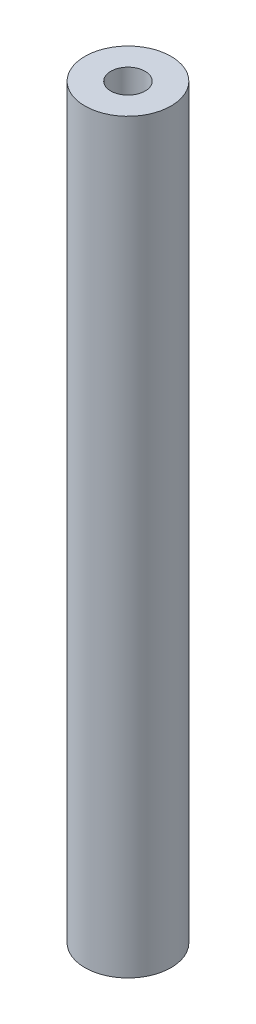
ISO-10303-21;
HEADER;
FILE_DESCRIPTION(('STEP AP214'),'2;1');
FILE_NAME('part.step','',(''),(''),'','','');
FILE_SCHEMA(('AUTOMOTIVE_DESIGN { 1 0 10303 214 1 1 1 1 }'));
ENDSEC;
DATA;
#1=APPLICATION_CONTEXT('core data for automotive mechanical design processes');
#2=APPLICATION_PROTOCOL_DEFINITION('international standard','automotive_design',2000,#1);
#3=PRODUCT_CONTEXT('',#1,'mechanical');
#4=PRODUCT('Part','Part','',(#3));
#5=PRODUCT_RELATED_PRODUCT_CATEGORY('part','',(#4));
#6=PRODUCT_DEFINITION_FORMATION('','',#4);
#7=PRODUCT_DEFINITION_CONTEXT('part definition',#1,'design');
#8=PRODUCT_DEFINITION('design','',#6,#7);
#9=PRODUCT_DEFINITION_SHAPE('','',#8);
#10=(LENGTH_UNIT() NAMED_UNIT(*) SI_UNIT(.MILLI.,.METRE.));
#11=(NAMED_UNIT(*) PLANE_ANGLE_UNIT() SI_UNIT($,.RADIAN.));
#12=(NAMED_UNIT(*) SI_UNIT($,.STERADIAN.) SOLID_ANGLE_UNIT());
#13=UNCERTAINTY_MEASURE_WITH_UNIT(LENGTH_MEASURE(1.E-05),#10,'distance_accuracy_value','');
#14=(GEOMETRIC_REPRESENTATION_CONTEXT(3) GLOBAL_UNCERTAINTY_ASSIGNED_CONTEXT((#13)) GLOBAL_UNIT_ASSIGNED_CONTEXT((#10,
#11,#12)) REPRESENTATION_CONTEXT('',''));
#15=CARTESIAN_POINT('',(0.,0.,0.));
#16=DIRECTION('',(0.,0.,1.));
#17=DIRECTION('',(1.,0.,0.));
#18=AXIS2_PLACEMENT_3D('',#15,#16,#17);
#19=CARTESIAN_POINT('',(-31.6080778217774,-139.528044181604,60.718552563549));
#20=DIRECTION('',(0.,1.,0.));
#21=DIRECTION('',(0.,0.,1.));
#22=AXIS2_PLACEMENT_3D('',#19,#20,#21);
#23=CYLINDRICAL_SURFACE('',#22,4.7625);
#24=CARTESIAN_POINT('',(-31.6080778217774,-126.05766,60.718552563549));
#25=DIRECTION('',(0.,1.,0.));
#26=DIRECTION('',(0.,0.,1.));
#27=AXIS2_PLACEMENT_3D('',#24,#25,#26);
#28=CIRCLE('',#27,4.7625);
#29=CARTESIAN_POINT('',(-31.6080778217774,-126.05766,65.481052563549));
#30=VERTEX_POINT('',#29);
#31=EDGE_CURVE('E11',#30,#30,#28,.F.);
#32=ORIENTED_EDGE('',*,*,#31,.F.);
#33=EDGE_LOOP('',(#32));
#34=FACE_BOUND('',#33,.T.);
#35=CARTESIAN_POINT('',(-31.6080778217774,-43.50766,60.718552563549));
#36=DIRECTION('',(0.,1.,0.));
#37=DIRECTION('',(0.,0.,1.));
#38=AXIS2_PLACEMENT_3D('',#35,#36,#37);
#39=CIRCLE('',#38,4.7625);
#40=CARTESIAN_POINT('',(-31.6080778217774,-43.50766,65.481052563549));
#41=VERTEX_POINT('',#40);
#42=EDGE_CURVE('E52',#41,#41,#39,.T.);
#43=ORIENTED_EDGE('',*,*,#42,.F.);
#44=EDGE_LOOP('',(#43));
#45=FACE_BOUND('',#44,.T.);
#46=ADVANCED_FACE('F45',(#34,#45),#23,.T.);
#47=CARTESIAN_POINT('',(-31.6080778217774,-43.50766,60.718552563549));
#48=DIRECTION('',(0.,1.,0.));
#49=DIRECTION('',(0.,0.,1.));
#50=AXIS2_PLACEMENT_3D('',#47,#48,#49);
#51=PLANE('',#50);
#52=CARTESIAN_POINT('',(-31.6080778217774,-43.50766,60.718552563549));
#53=DIRECTION('',(0.,1.,0.));
#54=DIRECTION('',(0.,0.,1.));
#55=AXIS2_PLACEMENT_3D('',#52,#53,#54);
#56=CIRCLE('',#55,1.89864999999999);
#57=CARTESIAN_POINT('',(-31.6080778217774,-43.50766,62.617202563549));
#58=VERTEX_POINT('',#57);
#59=EDGE_CURVE('E66',#58,#58,#56,.T.);
#60=ORIENTED_EDGE('',*,*,#59,.F.);
#61=EDGE_LOOP('',(#60));
#62=FACE_BOUND('',#61,.T.);
#63=ORIENTED_EDGE('',*,*,#42,.T.);
#64=EDGE_LOOP('',(#63));
#65=FACE_BOUND('',#64,.T.);
#66=ADVANCED_FACE('F76',(#62,#65),#51,.T.);
#67=CARTESIAN_POINT('',(0.,-126.05766,0.));
#68=DIRECTION('',(0.,1.,0.));
#69=DIRECTION('',(0.,0.,1.));
#70=AXIS2_PLACEMENT_3D('',#67,#68,#69);
#71=PLANE('',#70);
#72=ORIENTED_EDGE('',*,*,#31,.T.);
#73=EDGE_LOOP('',(#72));
#74=FACE_BOUND('',#73,.T.);
#75=ADVANCED_FACE('F59',(#74),#71,.F.);
#76=CARTESIAN_POINT('',(-31.6080778217774,-49.85766,60.718552563549));
#77=DIRECTION('',(0.,1.,0.));
#78=DIRECTION('',(0.,0.,1.));
#79=AXIS2_PLACEMENT_3D('',#76,#77,#78);
#80=CONICAL_SURFACE('',#79,1.89865,1.02974425867665);
#81=CARTESIAN_POINT('',(-31.6080778217774,-50.9984840143167,60.718552563549));
#82=VERTEX_POINT('',#81);
#83=VERTEX_LOOP('',#82);
#84=FACE_BOUND('',#83,.T.);
#85=CARTESIAN_POINT('',(-31.6080778217774,-49.85766,60.718552563549));
#86=DIRECTION('',(0.,1.,0.));
#87=DIRECTION('',(0.,0.,1.));
#88=AXIS2_PLACEMENT_3D('',#85,#86,#87);
#89=CIRCLE('',#88,1.89865);
#90=CARTESIAN_POINT('',(-31.6080778217774,-49.85766,62.617202563549));
#91=VERTEX_POINT('',#90);
#92=EDGE_CURVE('E63',#91,#91,#89,.T.);
#93=ORIENTED_EDGE('',*,*,#92,.T.);
#94=EDGE_LOOP('',(#93));
#95=FACE_BOUND('',#94,.T.);
#96=ADVANCED_FACE('F55',(#84,#95),#80,.F.);
#97=CARTESIAN_POINT('',(-31.6080778217774,-43.50766,60.718552563549));
#98=DIRECTION('',(0.,1.,0.));
#99=DIRECTION('',(0.,0.,1.));
#100=AXIS2_PLACEMENT_3D('',#97,#98,#99);
#101=CYLINDRICAL_SURFACE('',#100,1.89864999999999);
#102=ORIENTED_EDGE('',*,*,#92,.F.);
#103=EDGE_LOOP('',(#102));
#104=FACE_BOUND('',#103,.T.);
#105=ORIENTED_EDGE('',*,*,#59,.T.);
#106=EDGE_LOOP('',(#105));
#107=FACE_BOUND('',#106,.T.);
#108=ADVANCED_FACE('F58',(#104,#107),#101,.F.);
#109=CLOSED_SHELL('',(#46,#66,#75,#96,#108));
#110=MANIFOLD_SOLID_BREP('B2',#109);
#111=ADVANCED_BREP_SHAPE_REPRESENTATION('',(#18,#110),#14);
#112=SHAPE_DEFINITION_REPRESENTATION(#9,#111);
ENDSEC;
END-ISO-10303-21;
